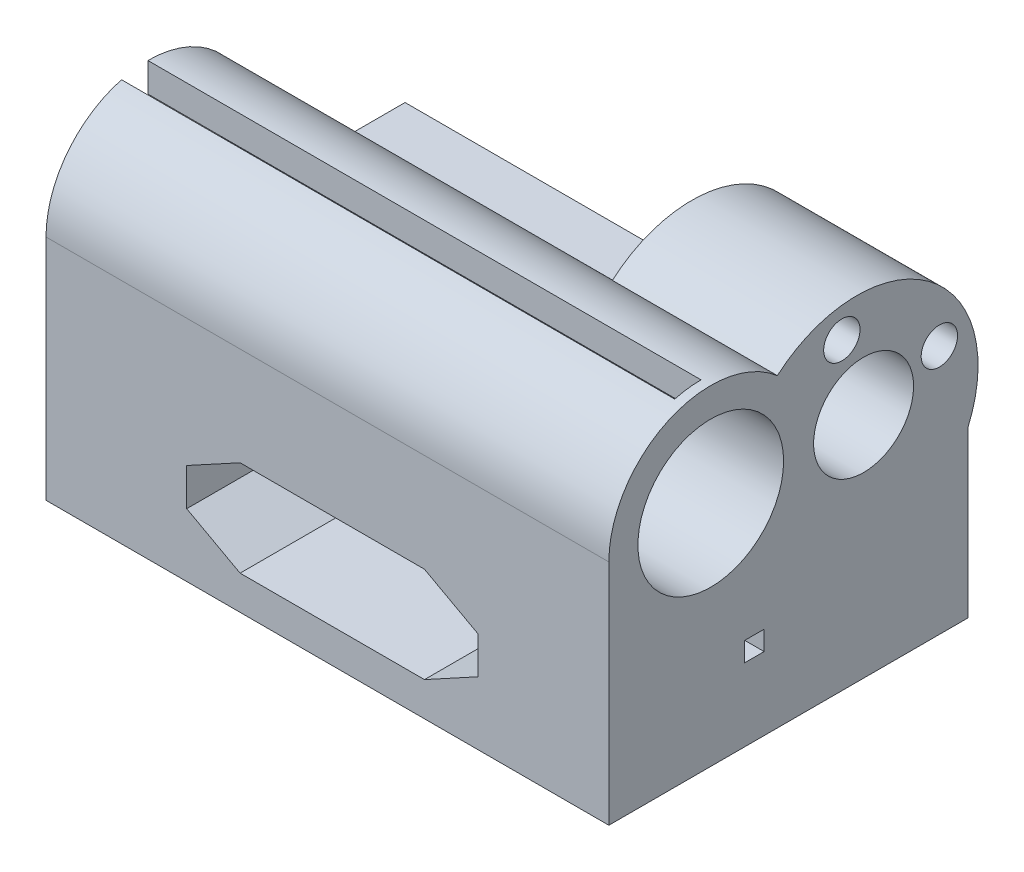
ISO-10303-21;
HEADER;
FILE_DESCRIPTION(('STEP AP214'),'2;1');
FILE_NAME('part.step','',(''),(''),'','','');
FILE_SCHEMA(('AUTOMOTIVE_DESIGN { 1 0 10303 214 1 1 1 1 }'));
ENDSEC;
DATA;
#1=APPLICATION_CONTEXT('core data for automotive mechanical design processes');
#2=APPLICATION_PROTOCOL_DEFINITION('international standard','automotive_design',2000,#1);
#3=PRODUCT_CONTEXT('',#1,'mechanical');
#4=PRODUCT('Part','Part','',(#3));
#5=PRODUCT_RELATED_PRODUCT_CATEGORY('part','',(#4));
#6=PRODUCT_DEFINITION_FORMATION('','',#4);
#7=PRODUCT_DEFINITION_CONTEXT('part definition',#1,'design');
#8=PRODUCT_DEFINITION('design','',#6,#7);
#9=PRODUCT_DEFINITION_SHAPE('','',#8);
#10=(LENGTH_UNIT() NAMED_UNIT(*) SI_UNIT(.MILLI.,.METRE.));
#11=(NAMED_UNIT(*) PLANE_ANGLE_UNIT() SI_UNIT($,.RADIAN.));
#12=(NAMED_UNIT(*) SI_UNIT($,.STERADIAN.) SOLID_ANGLE_UNIT());
#13=UNCERTAINTY_MEASURE_WITH_UNIT(LENGTH_MEASURE(1.E-05),#10,'distance_accuracy_value','');
#14=(GEOMETRIC_REPRESENTATION_CONTEXT(3) GLOBAL_UNCERTAINTY_ASSIGNED_CONTEXT((#13)) GLOBAL_UNIT_ASSIGNED_CONTEXT((#10,
#11,#12)) REPRESENTATION_CONTEXT('',''));
#15=CARTESIAN_POINT('',(0.,0.,0.));
#16=DIRECTION('',(0.,0.,1.));
#17=DIRECTION('',(1.,0.,0.));
#18=AXIS2_PLACEMENT_3D('',#15,#16,#17);
#19=CARTESIAN_POINT('',(29.,17.,18.5));
#20=DIRECTION('',(-1.,0.,0.));
#21=DIRECTION('',(0.,0.,1.));
#22=AXIS2_PLACEMENT_3D('',#19,#20,#21);
#23=PLANE('',#22);
#24=DIRECTION('',(0.,-1.,0.));
#25=VECTOR('',#24,1.);
#26=CARTESIAN_POINT('',(29.,17.,-18.5));
#27=LINE('',#26,#25);
#28=CARTESIAN_POINT('',(29.,17.,-18.5));
#29=VERTEX_POINT('',#28);
#30=CARTESIAN_POINT('',(29.,0.,-18.5));
#31=VERTEX_POINT('',#30);
#32=EDGE_CURVE('E439',#29,#31,#27,.T.);
#33=ORIENTED_EDGE('',*,*,#32,.F.);
#34=CARTESIAN_POINT('',(29.,22.,-7.04356076261039));
#35=DIRECTION('',(1.,0.,0.));
#36=DIRECTION('',(0.,0.,-1.));
#37=AXIS2_PLACEMENT_3D('',#34,#35,#36);
#38=CIRCLE('',#37,12.5);
#39=CARTESIAN_POINT('',(29.,31.4490069740523,1.1397311913841));
#40=VERTEX_POINT('',#39);
#41=EDGE_CURVE('E374',#29,#40,#38,.T.);
#42=ORIENTED_EDGE('',*,*,#41,.T.);
#43=CARTESIAN_POINT('',(29.,23.5,8.));
#44=DIRECTION('',(1.,0.,0.));
#45=DIRECTION('',(0.,0.,-1.));
#46=AXIS2_PLACEMENT_3D('',#43,#44,#45);
#47=CIRCLE('',#46,10.5);
#48=CARTESIAN_POINT('',(29.,23.5,18.5));
#49=VERTEX_POINT('',#48);
#50=EDGE_CURVE('E399',#40,#49,#47,.T.);
#51=ORIENTED_EDGE('',*,*,#50,.T.);
#52=DIRECTION('',(0.,-1.,0.));
#53=VECTOR('',#52,1.);
#54=CARTESIAN_POINT('',(29.,17.,18.5));
#55=LINE('',#54,#53);
#56=CARTESIAN_POINT('',(29.,0.,18.5));
#57=VERTEX_POINT('',#56);
#58=EDGE_CURVE('E422',#49,#57,#55,.T.);
#59=ORIENTED_EDGE('',*,*,#58,.T.);
#60=DIRECTION('',(0.,0.,-1.));
#61=VECTOR('',#60,1.);
#62=CARTESIAN_POINT('',(29.,0.,18.5));
#63=LINE('',#62,#61);
#64=EDGE_CURVE('E406',#57,#31,#63,.T.);
#65=ORIENTED_EDGE('',*,*,#64,.T.);
#66=EDGE_LOOP('',(#33,#42,#51,#59,#65));
#67=FACE_BOUND('',#66,.T.);
#68=CARTESIAN_POINT('',(29.,23.5,-7.7501439));
#69=DIRECTION('',(1.,0.,0.));
#70=DIRECTION('',(0.,0.,-1.));
#71=AXIS2_PLACEMENT_3D('',#68,#69,#70);
#72=CIRCLE('',#71,5.15);
#73=CARTESIAN_POINT('',(29.,23.5,-12.9001439));
#74=VERTEX_POINT('',#73);
#75=EDGE_CURVE('E308',#74,#74,#72,.T.);
#76=ORIENTED_EDGE('',*,*,#75,.F.);
#77=EDGE_LOOP('',(#76));
#78=FACE_BOUND('',#77,.T.);
#79=CARTESIAN_POINT('',(29.,23.5,8.));
#80=DIRECTION('',(1.,0.,0.));
#81=DIRECTION('',(0.,0.,-1.));
#82=AXIS2_PLACEMENT_3D('',#79,#80,#81);
#83=CIRCLE('',#82,7.5075);
#84=CARTESIAN_POINT('',(29.,23.5,0.492500000000002));
#85=VERTEX_POINT('',#84);
#86=EDGE_CURVE('E305',#85,#85,#83,.T.);
#87=ORIENTED_EDGE('',*,*,#86,.F.);
#88=EDGE_LOOP('',(#87));
#89=FACE_BOUND('',#88,.T.);
#90=CARTESIAN_POINT('',(29.,25.7404904729143,-15.5601264506066));
#91=DIRECTION('',(1.,0.,0.));
#92=DIRECTION('',(0.,0.,-1.));
#93=AXIS2_PLACEMENT_3D('',#90,#91,#92);
#94=CIRCLE('',#93,1.87500000000001);
#95=CARTESIAN_POINT('',(29.,25.7404904729143,-17.4351264506067));
#96=VERTEX_POINT('',#95);
#97=EDGE_CURVE('E294',#96,#96,#94,.T.);
#98=ORIENTED_EDGE('',*,*,#97,.F.);
#99=EDGE_LOOP('',(#98));
#100=FACE_BOUND('',#99,.T.);
#101=CARTESIAN_POINT('',(29.,31.3099825506067,-5.50965342708572));
#102=DIRECTION('',(1.,0.,0.));
#103=DIRECTION('',(0.,0.,-1.));
#104=AXIS2_PLACEMENT_3D('',#101,#102,#103);
#105=CIRCLE('',#104,1.875);
#106=CARTESIAN_POINT('',(29.,31.3099825506067,-7.38465342708572));
#107=VERTEX_POINT('',#106);
#108=EDGE_CURVE('E295',#107,#107,#105,.T.);
#109=ORIENTED_EDGE('',*,*,#108,.F.);
#110=EDGE_LOOP('',(#109));
#111=FACE_BOUND('',#110,.T.);
#112=DIRECTION('',(0.,1.,0.));
#113=VECTOR('',#112,1.);
#114=CARTESIAN_POINT('',(29.,7.5,4.5));
#115=LINE('',#114,#113);
#116=CARTESIAN_POINT('',(29.,7.5,4.5));
#117=VERTEX_POINT('',#116);
#118=CARTESIAN_POINT('',(29.,9.5,4.5));
#119=VERTEX_POINT('',#118);
#120=EDGE_CURVE('E58',#117,#119,#115,.T.);
#121=ORIENTED_EDGE('',*,*,#120,.T.);
#122=DIRECTION('',(0.,0.,-1.));
#123=VECTOR('',#122,1.);
#124=CARTESIAN_POINT('',(29.,9.5,4.5));
#125=LINE('',#124,#123);
#126=CARTESIAN_POINT('',(29.,9.5,2.5));
#127=VERTEX_POINT('',#126);
#128=EDGE_CURVE('E253',#119,#127,#125,.T.);
#129=ORIENTED_EDGE('',*,*,#128,.T.);
#130=DIRECTION('',(0.,-1.,0.));
#131=VECTOR('',#130,1.);
#132=CARTESIAN_POINT('',(29.,7.5,2.5));
#133=LINE('',#132,#131);
#134=CARTESIAN_POINT('',(29.,7.5,2.5));
#135=VERTEX_POINT('',#134);
#136=EDGE_CURVE('E250',#127,#135,#133,.T.);
#137=ORIENTED_EDGE('',*,*,#136,.T.);
#138=DIRECTION('',(0.,0.,1.));
#139=VECTOR('',#138,1.);
#140=CARTESIAN_POINT('',(29.,7.5,4.5));
#141=LINE('',#140,#139);
#142=EDGE_CURVE('E246',#135,#117,#141,.T.);
#143=ORIENTED_EDGE('',*,*,#142,.T.);
#144=EDGE_LOOP('',(#121,#129,#137,#143));
#145=FACE_BOUND('',#144,.T.);
#146=ADVANCED_FACE('F35',(#67,#78,#89,#100,#111,#145),#23,.F.);
#147=CARTESIAN_POINT('',(23.,8.5,4.5));
#148=DIRECTION('',(0.,0.,-1.));
#149=DIRECTION('',(-1.,0.,0.));
#150=AXIS2_PLACEMENT_3D('',#147,#148,#149);
#151=CYLINDRICAL_SURFACE('',#150,4.076);
#152=CARTESIAN_POINT('',(23.,8.5,-18.5));
#153=DIRECTION('',(0.,0.,-1.));
#154=DIRECTION('',(-1.,0.,0.));
#155=AXIS2_PLACEMENT_3D('',#152,#153,#154);
#156=CIRCLE('',#155,4.076);
#157=CARTESIAN_POINT('',(18.924,8.5,-18.5));
#158=VERTEX_POINT('',#157);
#159=EDGE_CURVE('E316',#158,#158,#156,.T.);
#160=ORIENTED_EDGE('',*,*,#159,.T.);
#161=EDGE_LOOP('',(#160));
#162=FACE_BOUND('',#161,.T.);
#163=DIRECTION('',(0.,0.,-1.));
#164=VECTOR('',#163,1.);
#165=CARTESIAN_POINT('',(26.9514270839787,9.5,4.5));
#166=LINE('',#165,#164);
#167=CARTESIAN_POINT('',(26.9514270839787,9.5,4.5));
#168=VERTEX_POINT('',#167);
#169=CARTESIAN_POINT('',(26.9514270839787,9.5,2.5));
#170=VERTEX_POINT('',#169);
#171=EDGE_CURVE('E266',#168,#170,#166,.T.);
#172=ORIENTED_EDGE('',*,*,#171,.F.);
#173=CARTESIAN_POINT('',(23.,8.5,4.5));
#174=DIRECTION('',(0.,0.,-1.));
#175=DIRECTION('',(-1.,0.,0.));
#176=AXIS2_PLACEMENT_3D('',#173,#174,#175);
#177=CIRCLE('',#176,4.076);
#178=CARTESIAN_POINT('',(26.9514270839787,7.5,4.5));
#179=VERTEX_POINT('',#178);
#180=EDGE_CURVE('E312',#179,#168,#177,.T.);
#181=ORIENTED_EDGE('',*,*,#180,.F.);
#182=DIRECTION('',(0.,0.,-1.));
#183=VECTOR('',#182,1.);
#184=CARTESIAN_POINT('',(26.9514270839787,7.5,4.5));
#185=LINE('',#184,#183);
#186=CARTESIAN_POINT('',(26.9514270839787,7.5,2.5));
#187=VERTEX_POINT('',#186);
#188=EDGE_CURVE('E259',#187,#179,#185,.F.);
#189=ORIENTED_EDGE('',*,*,#188,.F.);
#190=CARTESIAN_POINT('',(23.,8.5,2.5));
#191=DIRECTION('',(0.,0.,1.));
#192=DIRECTION('',(1.,0.,0.));
#193=AXIS2_PLACEMENT_3D('',#190,#191,#192);
#194=CIRCLE('',#193,4.076);
#195=EDGE_CURVE('E12',#170,#187,#194,.F.);
#196=ORIENTED_EDGE('',*,*,#195,.F.);
#197=EDGE_LOOP('',(#172,#181,#189,#196));
#198=FACE_BOUND('',#197,.T.);
#199=ADVANCED_FACE('F520',(#162,#198),#151,.F.);
#200=CARTESIAN_POINT('',(0.,17.,0.));
#201=DIRECTION('',(0.,-1.,0.));
#202=DIRECTION('',(0.,0.,-1.));
#203=AXIS2_PLACEMENT_3D('',#200,#201,#202);
#204=PLANE('',#203);
#205=CARTESIAN_POINT('',(0.500000000000004,17.,-11.5));
#206=DIRECTION('',(0.,-1.,0.));
#207=DIRECTION('',(0.,0.,-1.));
#208=AXIS2_PLACEMENT_3D('',#205,#206,#207);
#209=CIRCLE('',#208,1.5);
#210=CARTESIAN_POINT('',(0.500000000000004,17.,-13.));
#211=VERTEX_POINT('',#210);
#212=EDGE_CURVE('E914',#211,#211,#209,.T.);
#213=ORIENTED_EDGE('',*,*,#212,.T.);
#214=EDGE_LOOP('',(#213));
#215=FACE_BOUND('',#214,.T.);
#216=DIRECTION('',(0.,0.,1.));
#217=VECTOR('',#216,1.);
#218=CARTESIAN_POINT('',(12.,17.,0.));
#219=LINE('',#218,#217);
#220=CARTESIAN_POINT('',(12.,17.,-18.5));
#221=VERTEX_POINT('',#220);
#222=CARTESIAN_POINT('',(12.,17.,-2.5));
#223=VERTEX_POINT('',#222);
#224=EDGE_CURVE('E397',#221,#223,#219,.T.);
#225=ORIENTED_EDGE('',*,*,#224,.F.);
#226=DIRECTION('',(-1.,0.,0.));
#227=VECTOR('',#226,1.);
#228=CARTESIAN_POINT('',(-29.,17.,-18.5));
#229=LINE('',#228,#227);
#230=CARTESIAN_POINT('',(-29.,17.,-18.5));
#231=VERTEX_POINT('',#230);
#232=EDGE_CURVE('E419',#221,#231,#229,.T.);
#233=ORIENTED_EDGE('',*,*,#232,.T.);
#234=DIRECTION('',(0.,0.,1.));
#235=VECTOR('',#234,1.);
#236=CARTESIAN_POINT('',(-29.,17.,18.5));
#237=LINE('',#236,#235);
#238=CARTESIAN_POINT('',(-29.,17.,-2.5));
#239=VERTEX_POINT('',#238);
#240=EDGE_CURVE('E418',#231,#239,#237,.T.);
#241=ORIENTED_EDGE('',*,*,#240,.T.);
#242=DIRECTION('',(1.,0.,0.));
#243=VECTOR('',#242,1.);
#244=CARTESIAN_POINT('',(-56.0185121722126,17.,-2.5));
#245=LINE('',#244,#243);
#246=EDGE_CURVE('E411',#239,#223,#245,.T.);
#247=ORIENTED_EDGE('',*,*,#246,.T.);
#248=EDGE_LOOP('',(#225,#233,#241,#247));
#249=FACE_BOUND('',#248,.T.);
#250=ADVANCED_FACE('F507',(#215,#249),#204,.F.);
#251=CARTESIAN_POINT('',(-56.0185121722126,23.5,-2.5));
#252=DIRECTION('',(0.,0.,-1.));
#253=DIRECTION('',(-1.,0.,0.));
#254=AXIS2_PLACEMENT_3D('',#251,#252,#253);
#255=PLANE('',#254);
#256=DIRECTION('',(1.,0.,0.));
#257=VECTOR('',#256,1.);
#258=CARTESIAN_POINT('',(-56.0185121722126,23.5,-2.5));
#259=LINE('',#258,#257);
#260=CARTESIAN_POINT('',(-29.,23.5,-2.5));
#261=VERTEX_POINT('',#260);
#262=CARTESIAN_POINT('',(12.,23.5,-2.5));
#263=VERTEX_POINT('',#262);
#264=EDGE_CURVE('E402',#261,#263,#259,.T.);
#265=ORIENTED_EDGE('',*,*,#264,.T.);
#266=DIRECTION('',(0.,-1.,0.));
#267=VECTOR('',#266,1.);
#268=CARTESIAN_POINT('',(12.,23.5,-2.5));
#269=LINE('',#268,#267);
#270=EDGE_CURVE('E442',#263,#223,#269,.T.);
#271=ORIENTED_EDGE('',*,*,#270,.T.);
#272=ORIENTED_EDGE('',*,*,#246,.F.);
#273=DIRECTION('',(0.,-1.,0.));
#274=VECTOR('',#273,1.);
#275=CARTESIAN_POINT('',(-29.,23.5,-2.5));
#276=LINE('',#275,#274);
#277=EDGE_CURVE('E400',#261,#239,#276,.T.);
#278=ORIENTED_EDGE('',*,*,#277,.F.);
#279=EDGE_LOOP('',(#265,#271,#272,#278));
#280=FACE_BOUND('',#279,.T.);
#281=ADVANCED_FACE('F512',(#280),#255,.T.);
#282=CARTESIAN_POINT('',(-29.,17.,-18.5));
#283=DIRECTION('',(0.,0.,1.));
#284=DIRECTION('',(1.,0.,0.));
#285=AXIS2_PLACEMENT_3D('',#282,#283,#284);
#286=PLANE('',#285);
#287=ORIENTED_EDGE('',*,*,#159,.F.);
#288=EDGE_LOOP('',(#287));
#289=FACE_BOUND('',#288,.T.);
#290=CARTESIAN_POINT('',(-22.,8.5,-18.5));
#291=DIRECTION('',(0.,0.,-1.));
#292=DIRECTION('',(-1.,0.,0.));
#293=AXIS2_PLACEMENT_3D('',#290,#291,#292);
#294=CIRCLE('',#293,4.076);
#295=CARTESIAN_POINT('',(-26.076,8.5,-18.5));
#296=VERTEX_POINT('',#295);
#297=EDGE_CURVE('E322',#296,#296,#294,.T.);
#298=ORIENTED_EDGE('',*,*,#297,.F.);
#299=EDGE_LOOP('',(#298));
#300=FACE_BOUND('',#299,.T.);
#301=DIRECTION('',(-1.,0.,0.));
#302=VECTOR('',#301,1.);
#303=CARTESIAN_POINT('',(-8.99999999999999,3.5,-18.5));
#304=LINE('',#303,#302);
#305=CARTESIAN_POINT('',(10.,3.5,-18.5));
#306=VERTEX_POINT('',#305);
#307=CARTESIAN_POINT('',(-8.99999999999999,3.5,-18.5));
#308=VERTEX_POINT('',#307);
#309=EDGE_CURVE('E352',#306,#308,#304,.T.);
#310=ORIENTED_EDGE('',*,*,#309,.F.);
#311=DIRECTION('',(-0.877895572914384,-0.478852130680573,0.));
#312=VECTOR('',#311,1.);
#313=CARTESIAN_POINT('',(10.,3.5,-18.5));
#314=LINE('',#313,#312);
#315=CARTESIAN_POINT('',(15.5,6.5,-18.5));
#316=VERTEX_POINT('',#315);
#317=EDGE_CURVE('E315',#316,#306,#314,.T.);
#318=ORIENTED_EDGE('',*,*,#317,.F.);
#319=DIRECTION('',(0.,-1.,0.));
#320=VECTOR('',#319,1.);
#321=CARTESIAN_POINT('',(15.5,6.5,-18.5));
#322=LINE('',#321,#320);
#323=CARTESIAN_POINT('',(15.5,10.35,-18.5));
#324=VERTEX_POINT('',#323);
#325=EDGE_CURVE('E329',#324,#316,#322,.T.);
#326=ORIENTED_EDGE('',*,*,#325,.F.);
#327=DIRECTION('',(0.877895572914384,-0.478852130680573,0.));
#328=VECTOR('',#327,1.);
#329=CARTESIAN_POINT('',(15.5,10.35,-18.5));
#330=LINE('',#329,#328);
#331=CARTESIAN_POINT('',(10.,13.35,-18.5));
#332=VERTEX_POINT('',#331);
#333=EDGE_CURVE('E367',#332,#324,#330,.T.);
#334=ORIENTED_EDGE('',*,*,#333,.F.);
#335=DIRECTION('',(1.,0.,0.));
#336=VECTOR('',#335,1.);
#337=CARTESIAN_POINT('',(10.,13.35,-18.5));
#338=LINE('',#337,#336);
#339=CARTESIAN_POINT('',(-9.00000000000001,13.35,-18.5));
#340=VERTEX_POINT('',#339);
#341=EDGE_CURVE('E364',#340,#332,#338,.T.);
#342=ORIENTED_EDGE('',*,*,#341,.F.);
#343=DIRECTION('',(0.878365103433168,0.477990319013723,0.));
#344=VECTOR('',#343,1.);
#345=CARTESIAN_POINT('',(-9.00000000000001,13.35,-18.5));
#346=LINE('',#345,#344);
#347=CARTESIAN_POINT('',(-14.5,10.357,-18.5));
#348=VERTEX_POINT('',#347);
#349=EDGE_CURVE('E361',#348,#340,#346,.T.);
#350=ORIENTED_EDGE('',*,*,#349,.F.);
#351=DIRECTION('',(0.,1.,0.));
#352=VECTOR('',#351,1.);
#353=CARTESIAN_POINT('',(-14.5,10.357,-18.5));
#354=LINE('',#353,#352);
#355=CARTESIAN_POINT('',(-14.5,6.5,-18.5));
#356=VERTEX_POINT('',#355);
#357=EDGE_CURVE('E358',#356,#348,#354,.T.);
#358=ORIENTED_EDGE('',*,*,#357,.F.);
#359=DIRECTION('',(-0.877895572914384,0.478852130680573,0.));
#360=VECTOR('',#359,1.);
#361=CARTESIAN_POINT('',(-14.5,6.5,-18.5));
#362=LINE('',#361,#360);
#363=EDGE_CURVE('E355',#308,#356,#362,.T.);
#364=ORIENTED_EDGE('',*,*,#363,.F.);
#365=EDGE_LOOP('',(#310,#318,#326,#334,#342,#350,#358,#364));
#366=FACE_BOUND('',#365,.T.);
#367=DIRECTION('',(-1.,0.,0.));
#368=VECTOR('',#367,1.);
#369=CARTESIAN_POINT('',(-29.,0.,-18.5));
#370=LINE('',#369,#368);
#371=CARTESIAN_POINT('',(-29.,0.,-18.5));
#372=VERTEX_POINT('',#371);
#373=EDGE_CURVE('E425',#31,#372,#370,.T.);
#374=ORIENTED_EDGE('',*,*,#373,.T.);
#375=DIRECTION('',(0.,-1.,0.));
#376=VECTOR('',#375,1.);
#377=CARTESIAN_POINT('',(-29.,17.,-18.5));
#378=LINE('',#377,#376);
#379=EDGE_CURVE('E436',#231,#372,#378,.T.);
#380=ORIENTED_EDGE('',*,*,#379,.F.);
#381=ORIENTED_EDGE('',*,*,#232,.F.);
#382=EDGE_CURVE('E416',#29,#221,#229,.T.);
#383=ORIENTED_EDGE('',*,*,#382,.F.);
#384=ORIENTED_EDGE('',*,*,#32,.T.);
#385=EDGE_LOOP('',(#374,#380,#381,#383,#384));
#386=FACE_BOUND('',#385,.T.);
#387=ADVANCED_FACE('F478',(#289,#300,#366,#386),#286,.F.);
#388=CARTESIAN_POINT('',(-29.,17.,18.5));
#389=DIRECTION('',(1.,0.,0.));
#390=DIRECTION('',(0.,0.,-1.));
#391=AXIS2_PLACEMENT_3D('',#388,#389,#390);
#392=PLANE('',#391);
#393=DIRECTION('',(0.,0.,-1.));
#394=VECTOR('',#393,1.);
#395=CARTESIAN_POINT('',(-29.,9.5,4.5));
#396=LINE('',#395,#394);
#397=CARTESIAN_POINT('',(-29.,9.5,4.5));
#398=VERTEX_POINT('',#397);
#399=CARTESIAN_POINT('',(-29.,9.5,2.5));
#400=VERTEX_POINT('',#399);
#401=EDGE_CURVE('E270',#398,#400,#396,.T.);
#402=ORIENTED_EDGE('',*,*,#401,.F.);
#403=DIRECTION('',(0.,1.,0.));
#404=VECTOR('',#403,1.);
#405=CARTESIAN_POINT('',(-29.,7.5,4.5));
#406=LINE('',#405,#404);
#407=CARTESIAN_POINT('',(-29.,7.5,4.5));
#408=VERTEX_POINT('',#407);
#409=EDGE_CURVE('E268',#408,#398,#406,.T.);
#410=ORIENTED_EDGE('',*,*,#409,.F.);
#411=DIRECTION('',(0.,0.,1.));
#412=VECTOR('',#411,1.);
#413=CARTESIAN_POINT('',(-29.,7.5,4.5));
#414=LINE('',#413,#412);
#415=CARTESIAN_POINT('',(-29.,7.5,2.5));
#416=VERTEX_POINT('',#415);
#417=EDGE_CURVE('E276',#416,#408,#414,.T.);
#418=ORIENTED_EDGE('',*,*,#417,.F.);
#419=DIRECTION('',(0.,-1.,0.));
#420=VECTOR('',#419,1.);
#421=CARTESIAN_POINT('',(-29.,7.5,2.5));
#422=LINE('',#421,#420);
#423=EDGE_CURVE('E273',#400,#416,#422,.T.);
#424=ORIENTED_EDGE('',*,*,#423,.F.);
#425=EDGE_LOOP('',(#402,#410,#418,#424));
#426=FACE_BOUND('',#425,.T.);
#427=CARTESIAN_POINT('',(-29.,23.5,8.));
#428=DIRECTION('',(1.,0.,0.));
#429=DIRECTION('',(0.,0.,-1.));
#430=AXIS2_PLACEMENT_3D('',#427,#428,#429);
#431=CIRCLE('',#430,10.5);
#432=CARTESIAN_POINT('',(-29.,23.5,18.5));
#433=VERTEX_POINT('',#432);
#434=CARTESIAN_POINT('',(-29.,33.6422211760352,10.7175999735764));
#435=VERTEX_POINT('',#434);
#436=EDGE_CURVE('E403',#433,#435,#431,.F.);
#437=ORIENTED_EDGE('',*,*,#436,.T.);
#438=DIRECTION('',(0.,0.965925826289069,0.258819045102517));
#439=VECTOR('',#438,1.);
#440=CARTESIAN_POINT('',(-29.,-0.425798494467172,1.58910161513784));
#441=LINE('',#440,#439);
#442=CARTESIAN_POINT('',(-29.,30.7516881408652,9.94308398110716));
#443=VERTEX_POINT('',#442);
#444=EDGE_CURVE('E233',#443,#435,#441,.T.);
#445=ORIENTED_EDGE('',*,*,#444,.F.);
#446=CARTESIAN_POINT('',(-29.,23.5,8.));
#447=DIRECTION('',(1.,0.,0.));
#448=DIRECTION('',(0.,0.,-1.));
#449=AXIS2_PLACEMENT_3D('',#446,#447,#448);
#450=CIRCLE('',#449,7.5075);
#451=CARTESIAN_POINT('',(-29.,31.0075,8.00000000000003));
#452=VERTEX_POINT('',#451);
#453=EDGE_CURVE('E301',#443,#452,#450,.T.);
#454=ORIENTED_EDGE('',*,*,#453,.T.);
#455=DIRECTION('',(0.,-1.,0.));
#456=VECTOR('',#455,1.);
#457=CARTESIAN_POINT('',(-29.,0.,7.99999999999992));
#458=LINE('',#457,#456);
#459=CARTESIAN_POINT('',(-29.,34.,8.00000000000004));
#460=VERTEX_POINT('',#459);
#461=EDGE_CURVE('E913',#460,#452,#458,.T.);
#462=ORIENTED_EDGE('',*,*,#461,.F.);
#463=EDGE_CURVE('E238',#460,#261,#431,.F.);
#464=ORIENTED_EDGE('',*,*,#463,.T.);
#465=ORIENTED_EDGE('',*,*,#277,.T.);
#466=ORIENTED_EDGE('',*,*,#240,.F.);
#467=ORIENTED_EDGE('',*,*,#379,.T.);
#468=DIRECTION('',(0.,0.,1.));
#469=VECTOR('',#468,1.);
#470=CARTESIAN_POINT('',(-29.,0.,18.5));
#471=LINE('',#470,#469);
#472=CARTESIAN_POINT('',(-29.,0.,18.5));
#473=VERTEX_POINT('',#472);
#474=EDGE_CURVE('E427',#372,#473,#471,.T.);
#475=ORIENTED_EDGE('',*,*,#474,.T.);
#476=DIRECTION('',(0.,-1.,0.));
#477=VECTOR('',#476,1.);
#478=CARTESIAN_POINT('',(-29.,17.,18.5));
#479=LINE('',#478,#477);
#480=EDGE_CURVE('E433',#433,#473,#479,.T.);
#481=ORIENTED_EDGE('',*,*,#480,.F.);
#482=EDGE_LOOP('',(#437,#445,#454,#462,#464,#465,#466,#467,#475,#481));
#483=FACE_BOUND('',#482,.T.);
#484=ADVANCED_FACE('F474',(#426,#483),#392,.F.);
#485=CARTESIAN_POINT('',(-29.,17.,18.5));
#486=DIRECTION('',(0.,0.,-1.));
#487=DIRECTION('',(-1.,0.,0.));
#488=AXIS2_PLACEMENT_3D('',#485,#486,#487);
#489=PLANE('',#488);
#490=DIRECTION('',(0.,-1.,0.));
#491=VECTOR('',#490,1.);
#492=CARTESIAN_POINT('',(15.5,6.5,18.5));
#493=LINE('',#492,#491);
#494=CARTESIAN_POINT('',(15.5,10.35,18.5));
#495=VERTEX_POINT('',#494);
#496=CARTESIAN_POINT('',(15.5,6.5,18.5));
#497=VERTEX_POINT('',#496);
#498=EDGE_CURVE('E347',#495,#497,#493,.T.);
#499=ORIENTED_EDGE('',*,*,#498,.T.);
#500=DIRECTION('',(-0.877895572914384,-0.478852130680573,0.));
#501=VECTOR('',#500,1.);
#502=CARTESIAN_POINT('',(10.,3.5,18.5));
#503=LINE('',#502,#501);
#504=CARTESIAN_POINT('',(10.,3.5,18.5));
#505=VERTEX_POINT('',#504);
#506=EDGE_CURVE('E325',#497,#505,#503,.T.);
#507=ORIENTED_EDGE('',*,*,#506,.T.);
#508=DIRECTION('',(-1.,0.,0.));
#509=VECTOR('',#508,1.);
#510=CARTESIAN_POINT('',(-8.99999999999999,3.5,18.5));
#511=LINE('',#510,#509);
#512=CARTESIAN_POINT('',(-8.99999999999999,3.5,18.5));
#513=VERTEX_POINT('',#512);
#514=EDGE_CURVE('E328',#505,#513,#511,.T.);
#515=ORIENTED_EDGE('',*,*,#514,.T.);
#516=DIRECTION('',(-0.877895572914384,0.478852130680573,0.));
#517=VECTOR('',#516,1.);
#518=CARTESIAN_POINT('',(-14.5,6.5,18.5));
#519=LINE('',#518,#517);
#520=CARTESIAN_POINT('',(-14.5,6.5,18.5));
#521=VERTEX_POINT('',#520);
#522=EDGE_CURVE('E332',#513,#521,#519,.T.);
#523=ORIENTED_EDGE('',*,*,#522,.T.);
#524=DIRECTION('',(0.,1.,0.));
#525=VECTOR('',#524,1.);
#526=CARTESIAN_POINT('',(-14.5,10.357,18.5));
#527=LINE('',#526,#525);
#528=CARTESIAN_POINT('',(-14.5,10.357,18.5));
#529=VERTEX_POINT('',#528);
#530=EDGE_CURVE('E335',#521,#529,#527,.T.);
#531=ORIENTED_EDGE('',*,*,#530,.T.);
#532=DIRECTION('',(0.878365103433168,0.477990319013723,0.));
#533=VECTOR('',#532,1.);
#534=CARTESIAN_POINT('',(-9.00000000000001,13.35,18.5));
#535=LINE('',#534,#533);
#536=CARTESIAN_POINT('',(-9.00000000000001,13.35,18.5));
#537=VERTEX_POINT('',#536);
#538=EDGE_CURVE('E338',#529,#537,#535,.T.);
#539=ORIENTED_EDGE('',*,*,#538,.T.);
#540=DIRECTION('',(1.,0.,0.));
#541=VECTOR('',#540,1.);
#542=CARTESIAN_POINT('',(10.,13.35,18.5));
#543=LINE('',#542,#541);
#544=CARTESIAN_POINT('',(10.,13.35,18.5));
#545=VERTEX_POINT('',#544);
#546=EDGE_CURVE('E341',#537,#545,#543,.T.);
#547=ORIENTED_EDGE('',*,*,#546,.T.);
#548=DIRECTION('',(0.877895572914384,-0.478852130680573,0.));
#549=VECTOR('',#548,1.);
#550=CARTESIAN_POINT('',(15.5,10.35,18.5));
#551=LINE('',#550,#549);
#552=EDGE_CURVE('E344',#545,#495,#551,.T.);
#553=ORIENTED_EDGE('',*,*,#552,.T.);
#554=EDGE_LOOP('',(#499,#507,#515,#523,#531,#539,#547,#553));
#555=FACE_BOUND('',#554,.T.);
#556=DIRECTION('',(1.,0.,0.));
#557=VECTOR('',#556,1.);
#558=CARTESIAN_POINT('',(-29.,0.,18.5));
#559=LINE('',#558,#557);
#560=EDGE_CURVE('E429',#473,#57,#559,.T.);
#561=ORIENTED_EDGE('',*,*,#560,.T.);
#562=ORIENTED_EDGE('',*,*,#58,.F.);
#563=DIRECTION('',(1.,0.,0.));
#564=VECTOR('',#563,1.);
#565=CARTESIAN_POINT('',(-56.0185121722126,23.5,18.5));
#566=LINE('',#565,#564);
#567=EDGE_CURVE('E408',#433,#49,#566,.T.);
#568=ORIENTED_EDGE('',*,*,#567,.F.);
#569=ORIENTED_EDGE('',*,*,#480,.T.);
#570=EDGE_LOOP('',(#561,#562,#568,#569));
#571=FACE_BOUND('',#570,.T.);
#572=ADVANCED_FACE('F477',(#555,#571),#489,.F.);
#573=CARTESIAN_POINT('',(0.,0.,0.));
#574=DIRECTION('',(0.,-1.,0.));
#575=DIRECTION('',(0.,0.,-1.));
#576=AXIS2_PLACEMENT_3D('',#573,#574,#575);
#577=PLANE('',#576);
#578=CARTESIAN_POINT('',(0.500000000000004,0.,-11.5));
#579=DIRECTION('',(0.,-1.,0.));
#580=DIRECTION('',(0.,0.,-1.));
#581=AXIS2_PLACEMENT_3D('',#578,#579,#580);
#582=CIRCLE('',#581,1.5);
#583=CARTESIAN_POINT('',(0.500000000000004,0.,-13.));
#584=VERTEX_POINT('',#583);
#585=EDGE_CURVE('E925',#584,#584,#582,.T.);
#586=ORIENTED_EDGE('',*,*,#585,.F.);
#587=EDGE_LOOP('',(#586));
#588=FACE_BOUND('',#587,.T.);
#589=ORIENTED_EDGE('',*,*,#64,.F.);
#590=ORIENTED_EDGE('',*,*,#560,.F.);
#591=ORIENTED_EDGE('',*,*,#474,.F.);
#592=ORIENTED_EDGE('',*,*,#373,.F.);
#593=EDGE_LOOP('',(#589,#590,#591,#592));
#594=FACE_BOUND('',#593,.T.);
#595=ADVANCED_FACE('F493',(#588,#594),#577,.T.);
#596=CARTESIAN_POINT('',(-56.0185121722126,23.5,8.));
#597=DIRECTION('',(1.,0.,0.));
#598=DIRECTION('',(0.,0.,-1.));
#599=AXIS2_PLACEMENT_3D('',#596,#597,#598);
#600=CYLINDRICAL_SURFACE('',#599,10.5);
#601=DIRECTION('',(-1.,0.,0.));
#602=VECTOR('',#601,1.);
#603=CARTESIAN_POINT('',(28.,33.6422211760352,10.7175999735764));
#604=LINE('',#603,#602);
#605=CARTESIAN_POINT('',(28.,33.6422211760352,10.7175999735764));
#606=VERTEX_POINT('',#605);
#607=EDGE_CURVE('E247',#606,#435,#604,.T.);
#608=ORIENTED_EDGE('',*,*,#607,.T.);
#609=ORIENTED_EDGE('',*,*,#436,.F.);
#610=ORIENTED_EDGE('',*,*,#567,.T.);
#611=ORIENTED_EDGE('',*,*,#50,.F.);
#612=DIRECTION('',(1.,0.,0.));
#613=VECTOR('',#612,1.);
#614=CARTESIAN_POINT('',(20.5,31.4490069740523,1.13973119138409));
#615=LINE('',#614,#613);
#616=CARTESIAN_POINT('',(12.,31.4490069740523,1.1397311913841));
#617=VERTEX_POINT('',#616);
#618=EDGE_CURVE('E445',#617,#40,#615,.T.);
#619=ORIENTED_EDGE('',*,*,#618,.F.);
#620=CARTESIAN_POINT('',(12.,23.5,8.));
#621=DIRECTION('',(1.,0.,0.));
#622=DIRECTION('',(0.,0.,-1.));
#623=AXIS2_PLACEMENT_3D('',#620,#621,#622);
#624=CIRCLE('',#623,10.5);
#625=EDGE_CURVE('E392',#617,#263,#624,.F.);
#626=ORIENTED_EDGE('',*,*,#625,.T.);
#627=ORIENTED_EDGE('',*,*,#264,.F.);
#628=ORIENTED_EDGE('',*,*,#463,.F.);
#629=DIRECTION('',(-1.,0.,0.));
#630=VECTOR('',#629,1.);
#631=CARTESIAN_POINT('',(28.,34.,8.00000000000004));
#632=LINE('',#631,#630);
#633=CARTESIAN_POINT('',(28.,34.,8.00000000000004));
#634=VERTEX_POINT('',#633);
#635=EDGE_CURVE('E218',#634,#460,#632,.T.);
#636=ORIENTED_EDGE('',*,*,#635,.F.);
#637=CARTESIAN_POINT('',(28.,23.5,8.));
#638=DIRECTION('',(-1.,0.,0.));
#639=DIRECTION('',(0.,0.,1.));
#640=AXIS2_PLACEMENT_3D('',#637,#638,#639);
#641=CIRCLE('',#640,10.5);
#642=EDGE_CURVE('E224',#606,#634,#641,.T.);
#643=ORIENTED_EDGE('',*,*,#642,.F.);
#644=EDGE_LOOP('',(#608,#609,#610,#611,#619,#626,#627,#628,#636,#643));
#645=FACE_BOUND('',#644,.T.);
#646=ADVANCED_FACE('F236',(#645),#600,.T.);
#647=CARTESIAN_POINT('',(12.,22.,-7.04356076261039));
#648=DIRECTION('',(1.,0.,0.));
#649=DIRECTION('',(0.,0.,-1.));
#650=AXIS2_PLACEMENT_3D('',#647,#648,#649);
#651=CYLINDRICAL_SURFACE('',#650,12.5);
#652=ORIENTED_EDGE('',*,*,#382,.T.);
#653=CARTESIAN_POINT('',(12.,22.,-7.04356076261039));
#654=DIRECTION('',(1.,0.,0.));
#655=DIRECTION('',(0.,0.,-1.));
#656=AXIS2_PLACEMENT_3D('',#653,#654,#655);
#657=CIRCLE('',#656,12.5);
#658=EDGE_CURVE('E389',#221,#617,#657,.T.);
#659=ORIENTED_EDGE('',*,*,#658,.T.);
#660=ORIENTED_EDGE('',*,*,#618,.T.);
#661=ORIENTED_EDGE('',*,*,#41,.F.);
#662=EDGE_LOOP('',(#652,#659,#660,#661));
#663=FACE_BOUND('',#662,.T.);
#664=ADVANCED_FACE('F501',(#663),#651,.T.);
#665=CARTESIAN_POINT('',(12.,22.,-7.04356076261039));
#666=DIRECTION('',(1.,0.,0.));
#667=DIRECTION('',(0.,0.,-1.));
#668=AXIS2_PLACEMENT_3D('',#665,#666,#667);
#669=PLANE('',#668);
#670=CARTESIAN_POINT('',(12.,31.3099825506067,-5.50965342708572));
#671=DIRECTION('',(1.,0.,0.));
#672=DIRECTION('',(0.,0.,-1.));
#673=AXIS2_PLACEMENT_3D('',#670,#671,#672);
#674=CIRCLE('',#673,1.875);
#675=CARTESIAN_POINT('',(12.,31.3099825506067,-7.38465342708572));
#676=VERTEX_POINT('',#675);
#677=EDGE_CURVE('E311',#676,#676,#674,.T.);
#678=ORIENTED_EDGE('',*,*,#677,.T.);
#679=EDGE_LOOP('',(#678));
#680=FACE_BOUND('',#679,.T.);
#681=CARTESIAN_POINT('',(12.,25.7404904729143,-15.5601264506066));
#682=DIRECTION('',(1.,0.,0.));
#683=DIRECTION('',(0.,0.,-1.));
#684=AXIS2_PLACEMENT_3D('',#681,#682,#683);
#685=CIRCLE('',#684,1.87500000000001);
#686=CARTESIAN_POINT('',(12.,25.7404904729143,-17.4351264506067));
#687=VERTEX_POINT('',#686);
#688=EDGE_CURVE('E298',#687,#687,#685,.T.);
#689=ORIENTED_EDGE('',*,*,#688,.T.);
#690=EDGE_LOOP('',(#689));
#691=FACE_BOUND('',#690,.T.);
#692=CARTESIAN_POINT('',(12.,23.5,-7.7501439));
#693=DIRECTION('',(1.,0.,0.));
#694=DIRECTION('',(0.,0.,-1.));
#695=AXIS2_PLACEMENT_3D('',#692,#693,#694);
#696=CIRCLE('',#695,5.15);
#697=CARTESIAN_POINT('',(12.,23.5,-12.9001439));
#698=VERTEX_POINT('',#697);
#699=EDGE_CURVE('E304',#698,#698,#696,.T.);
#700=ORIENTED_EDGE('',*,*,#699,.T.);
#701=EDGE_LOOP('',(#700));
#702=FACE_BOUND('',#701,.T.);
#703=ORIENTED_EDGE('',*,*,#658,.F.);
#704=ORIENTED_EDGE('',*,*,#224,.T.);
#705=ORIENTED_EDGE('',*,*,#270,.F.);
#706=ORIENTED_EDGE('',*,*,#625,.F.);
#707=EDGE_LOOP('',(#703,#704,#705,#706));
#708=FACE_BOUND('',#707,.T.);
#709=ADVANCED_FACE('F505',(#680,#691,#702,#708),#669,.F.);
#710=CARTESIAN_POINT('',(10.,3.5,18.5));
#711=DIRECTION('',(0.478852130680573,-0.877895572914384,0.));
#712=DIRECTION('',(0.877895572914384,0.478852130680573,0.));
#713=AXIS2_PLACEMENT_3D('',#710,#711,#712);
#714=PLANE('',#713);
#715=ORIENTED_EDGE('',*,*,#317,.T.);
#716=DIRECTION('',(0.,0.,-1.));
#717=VECTOR('',#716,1.);
#718=CARTESIAN_POINT('',(10.,3.5,18.5));
#719=LINE('',#718,#717);
#720=EDGE_CURVE('E350',#505,#306,#719,.T.);
#721=ORIENTED_EDGE('',*,*,#720,.F.);
#722=ORIENTED_EDGE('',*,*,#506,.F.);
#723=DIRECTION('',(0.,0.,-1.));
#724=VECTOR('',#723,1.);
#725=CARTESIAN_POINT('',(15.5,6.5,18.5));
#726=LINE('',#725,#724);
#727=EDGE_CURVE('E372',#497,#316,#726,.T.);
#728=ORIENTED_EDGE('',*,*,#727,.T.);
#729=EDGE_LOOP('',(#715,#721,#722,#728));
#730=FACE_BOUND('',#729,.T.);
#731=ADVANCED_FACE('F547',(#730),#714,.F.);
#732=CARTESIAN_POINT('',(15.5,6.5,18.5));
#733=DIRECTION('',(1.,0.,0.));
#734=DIRECTION('',(0.,0.,-1.));
#735=AXIS2_PLACEMENT_3D('',#732,#733,#734);
#736=PLANE('',#735);
#737=ORIENTED_EDGE('',*,*,#325,.T.);
#738=ORIENTED_EDGE('',*,*,#727,.F.);
#739=ORIENTED_EDGE('',*,*,#498,.F.);
#740=DIRECTION('',(0.,0.,-1.));
#741=VECTOR('',#740,1.);
#742=CARTESIAN_POINT('',(15.5,10.35,18.5));
#743=LINE('',#742,#741);
#744=EDGE_CURVE('E375',#495,#324,#743,.T.);
#745=ORIENTED_EDGE('',*,*,#744,.T.);
#746=EDGE_LOOP('',(#737,#738,#739,#745));
#747=FACE_BOUND('',#746,.T.);
#748=ADVANCED_FACE('F543',(#747),#736,.F.);
#749=CARTESIAN_POINT('',(15.5,10.35,18.5));
#750=DIRECTION('',(0.478852130680573,0.877895572914384,0.));
#751=DIRECTION('',(-0.877895572914384,0.478852130680573,0.));
#752=AXIS2_PLACEMENT_3D('',#749,#750,#751);
#753=PLANE('',#752);
#754=ORIENTED_EDGE('',*,*,#333,.T.);
#755=ORIENTED_EDGE('',*,*,#744,.F.);
#756=ORIENTED_EDGE('',*,*,#552,.F.);
#757=DIRECTION('',(0.,0.,-1.));
#758=VECTOR('',#757,1.);
#759=CARTESIAN_POINT('',(10.,13.35,18.5));
#760=LINE('',#759,#758);
#761=EDGE_CURVE('E377',#545,#332,#760,.T.);
#762=ORIENTED_EDGE('',*,*,#761,.T.);
#763=EDGE_LOOP('',(#754,#755,#756,#762));
#764=FACE_BOUND('',#763,.T.);
#765=ADVANCED_FACE('F546',(#764),#753,.F.);
#766=CARTESIAN_POINT('',(10.,13.35,18.5));
#767=DIRECTION('',(0.,1.,0.));
#768=DIRECTION('',(0.,0.,1.));
#769=AXIS2_PLACEMENT_3D('',#766,#767,#768);
#770=PLANE('',#769);
#771=CARTESIAN_POINT('',(0.500000000000004,13.35,-11.5));
#772=DIRECTION('',(0.,1.,0.));
#773=DIRECTION('',(0.,0.,1.));
#774=AXIS2_PLACEMENT_3D('',#771,#772,#773);
#775=CIRCLE('',#774,1.5);
#776=CARTESIAN_POINT('',(0.500000000000004,13.35,-9.99999999999999));
#777=VERTEX_POINT('',#776);
#778=EDGE_CURVE('E918',#777,#777,#775,.T.);
#779=ORIENTED_EDGE('',*,*,#778,.T.);
#780=EDGE_LOOP('',(#779));
#781=FACE_BOUND('',#780,.T.);
#782=ORIENTED_EDGE('',*,*,#341,.T.);
#783=ORIENTED_EDGE('',*,*,#761,.F.);
#784=ORIENTED_EDGE('',*,*,#546,.F.);
#785=DIRECTION('',(0.,0.,-1.));
#786=VECTOR('',#785,1.);
#787=CARTESIAN_POINT('',(-9.00000000000001,13.35,18.5));
#788=LINE('',#787,#786);
#789=EDGE_CURVE('E379',#537,#340,#788,.T.);
#790=ORIENTED_EDGE('',*,*,#789,.T.);
#791=EDGE_LOOP('',(#782,#783,#784,#790));
#792=FACE_BOUND('',#791,.T.);
#793=ADVANCED_FACE('F551',(#781,#792),#770,.F.);
#794=CARTESIAN_POINT('',(-9.00000000000001,13.35,18.5));
#795=DIRECTION('',(-0.477990319013722,0.878365103433168,0.));
#796=DIRECTION('',(-0.878365103433168,-0.477990319013722,0.));
#797=AXIS2_PLACEMENT_3D('',#794,#795,#796);
#798=PLANE('',#797);
#799=ORIENTED_EDGE('',*,*,#349,.T.);
#800=ORIENTED_EDGE('',*,*,#789,.F.);
#801=ORIENTED_EDGE('',*,*,#538,.F.);
#802=DIRECTION('',(0.,0.,-1.));
#803=VECTOR('',#802,1.);
#804=CARTESIAN_POINT('',(-14.5,10.357,18.5));
#805=LINE('',#804,#803);
#806=EDGE_CURVE('E381',#529,#348,#805,.T.);
#807=ORIENTED_EDGE('',*,*,#806,.T.);
#808=EDGE_LOOP('',(#799,#800,#801,#807));
#809=FACE_BOUND('',#808,.T.);
#810=ADVANCED_FACE('F555',(#809),#798,.F.);
#811=CARTESIAN_POINT('',(-14.5,10.357,18.5));
#812=DIRECTION('',(-1.,0.,0.));
#813=DIRECTION('',(0.,-1.,0.));
#814=AXIS2_PLACEMENT_3D('',#811,#812,#813);
#815=PLANE('',#814);
#816=ORIENTED_EDGE('',*,*,#357,.T.);
#817=ORIENTED_EDGE('',*,*,#806,.F.);
#818=ORIENTED_EDGE('',*,*,#530,.F.);
#819=DIRECTION('',(0.,0.,-1.));
#820=VECTOR('',#819,1.);
#821=CARTESIAN_POINT('',(-14.5,6.5,18.5));
#822=LINE('',#821,#820);
#823=EDGE_CURVE('E383',#521,#356,#822,.T.);
#824=ORIENTED_EDGE('',*,*,#823,.T.);
#825=EDGE_LOOP('',(#816,#817,#818,#824));
#826=FACE_BOUND('',#825,.T.);
#827=ADVANCED_FACE('F559',(#826),#815,.F.);
#828=CARTESIAN_POINT('',(-14.5,6.5,18.5));
#829=DIRECTION('',(-0.478852130680573,-0.877895572914384,0.));
#830=DIRECTION('',(0.877895572914384,-0.478852130680573,0.));
#831=AXIS2_PLACEMENT_3D('',#828,#829,#830);
#832=PLANE('',#831);
#833=ORIENTED_EDGE('',*,*,#363,.T.);
#834=ORIENTED_EDGE('',*,*,#823,.F.);
#835=ORIENTED_EDGE('',*,*,#522,.F.);
#836=DIRECTION('',(0.,0.,-1.));
#837=VECTOR('',#836,1.);
#838=CARTESIAN_POINT('',(-8.99999999999999,3.5,18.5));
#839=LINE('',#838,#837);
#840=EDGE_CURVE('E385',#513,#308,#839,.T.);
#841=ORIENTED_EDGE('',*,*,#840,.T.);
#842=EDGE_LOOP('',(#833,#834,#835,#841));
#843=FACE_BOUND('',#842,.T.);
#844=ADVANCED_FACE('F563',(#843),#832,.F.);
#845=CARTESIAN_POINT('',(-8.99999999999999,3.5,18.5));
#846=DIRECTION('',(0.,-1.,0.));
#847=DIRECTION('',(1.,0.,0.));
#848=AXIS2_PLACEMENT_3D('',#845,#846,#847);
#849=PLANE('',#848);
#850=CARTESIAN_POINT('',(0.500000000000004,3.5,-11.5));
#851=DIRECTION('',(0.,-1.,0.));
#852=DIRECTION('',(1.,0.,0.));
#853=AXIS2_PLACEMENT_3D('',#850,#851,#852);
#854=CIRCLE('',#853,1.5);
#855=CARTESIAN_POINT('',(2.,3.5,-11.5));
#856=VERTEX_POINT('',#855);
#857=EDGE_CURVE('E38',#856,#856,#854,.T.);
#858=ORIENTED_EDGE('',*,*,#857,.T.);
#859=EDGE_LOOP('',(#858));
#860=FACE_BOUND('',#859,.T.);
#861=ORIENTED_EDGE('',*,*,#309,.T.);
#862=ORIENTED_EDGE('',*,*,#840,.F.);
#863=ORIENTED_EDGE('',*,*,#514,.F.);
#864=ORIENTED_EDGE('',*,*,#720,.T.);
#865=EDGE_LOOP('',(#861,#862,#863,#864));
#866=FACE_BOUND('',#865,.T.);
#867=ADVANCED_FACE('F542',(#860,#866),#849,.F.);
#868=CARTESIAN_POINT('',(-22.,8.5,4.5));
#869=DIRECTION('',(0.,0.,-1.));
#870=DIRECTION('',(-1.,0.,0.));
#871=AXIS2_PLACEMENT_3D('',#868,#869,#870);
#872=CYLINDRICAL_SURFACE('',#871,4.076);
#873=CARTESIAN_POINT('',(-22.,8.5,2.5));
#874=DIRECTION('',(0.,0.,-1.));
#875=DIRECTION('',(-1.,0.,0.));
#876=AXIS2_PLACEMENT_3D('',#873,#874,#875);
#877=CIRCLE('',#876,4.076);
#878=CARTESIAN_POINT('',(-25.9514270839786,9.5,2.5));
#879=VERTEX_POINT('',#878);
#880=CARTESIAN_POINT('',(-25.9514270839786,7.5,2.5));
#881=VERTEX_POINT('',#880);
#882=EDGE_CURVE('E43',#879,#881,#877,.F.);
#883=ORIENTED_EDGE('',*,*,#882,.T.);
#884=DIRECTION('',(0.,0.,-1.));
#885=VECTOR('',#884,1.);
#886=CARTESIAN_POINT('',(-25.9514270839786,7.5,4.5));
#887=LINE('',#886,#885);
#888=CARTESIAN_POINT('',(-25.9514270839786,7.5,4.5));
#889=VERTEX_POINT('',#888);
#890=EDGE_CURVE('E291',#881,#889,#887,.F.);
#891=ORIENTED_EDGE('',*,*,#890,.T.);
#892=CARTESIAN_POINT('',(-22.,8.5,4.5));
#893=DIRECTION('',(0.,0.,-1.));
#894=DIRECTION('',(-1.,0.,0.));
#895=AXIS2_PLACEMENT_3D('',#892,#893,#894);
#896=CIRCLE('',#895,4.076);
#897=CARTESIAN_POINT('',(-25.9514270839786,9.5,4.5));
#898=VERTEX_POINT('',#897);
#899=EDGE_CURVE('E319',#898,#889,#896,.T.);
#900=ORIENTED_EDGE('',*,*,#899,.F.);
#901=DIRECTION('',(0.,0.,-1.));
#902=VECTOR('',#901,1.);
#903=CARTESIAN_POINT('',(-25.9514270839786,9.5,4.5));
#904=LINE('',#903,#902);
#905=EDGE_CURVE('E282',#898,#879,#904,.T.);
#906=ORIENTED_EDGE('',*,*,#905,.T.);
#907=EDGE_LOOP('',(#883,#891,#900,#906));
#908=FACE_BOUND('',#907,.T.);
#909=ORIENTED_EDGE('',*,*,#297,.T.);
#910=EDGE_LOOP('',(#909));
#911=FACE_BOUND('',#910,.T.);
#912=ADVANCED_FACE('F456',(#908,#911),#872,.F.);
#913=CARTESIAN_POINT('',(-22.,8.5,4.5));
#914=DIRECTION('',(0.,0.,-1.));
#915=DIRECTION('',(-1.,0.,0.));
#916=AXIS2_PLACEMENT_3D('',#913,#914,#915);
#917=PLANE('',#916);
#918=ORIENTED_EDGE('',*,*,#899,.T.);
#919=DIRECTION('',(-1.,0.,0.));
#920=VECTOR('',#919,1.);
#921=CARTESIAN_POINT('',(-21.,7.5,4.5));
#922=LINE('',#921,#920);
#923=EDGE_CURVE('E280',#889,#408,#922,.T.);
#924=ORIENTED_EDGE('',*,*,#923,.T.);
#925=ORIENTED_EDGE('',*,*,#409,.T.);
#926=DIRECTION('',(-1.,0.,0.));
#927=VECTOR('',#926,1.);
#928=CARTESIAN_POINT('',(-21.,9.5,4.5));
#929=LINE('',#928,#927);
#930=EDGE_CURVE('E279',#898,#398,#929,.T.);
#931=ORIENTED_EDGE('',*,*,#930,.F.);
#932=EDGE_LOOP('',(#918,#924,#925,#931));
#933=FACE_BOUND('',#932,.T.);
#934=ADVANCED_FACE('F468',(#933),#917,.T.);
#935=CARTESIAN_POINT('',(23.,8.5,4.5));
#936=DIRECTION('',(0.,0.,-1.));
#937=DIRECTION('',(-1.,0.,0.));
#938=AXIS2_PLACEMENT_3D('',#935,#936,#937);
#939=PLANE('',#938);
#940=ORIENTED_EDGE('',*,*,#180,.T.);
#941=DIRECTION('',(1.,0.,0.));
#942=VECTOR('',#941,1.);
#943=CARTESIAN_POINT('',(21.,9.5,4.5));
#944=LINE('',#943,#942);
#945=EDGE_CURVE('E257',#168,#119,#944,.T.);
#946=ORIENTED_EDGE('',*,*,#945,.T.);
#947=ORIENTED_EDGE('',*,*,#120,.F.);
#948=DIRECTION('',(1.,0.,0.));
#949=VECTOR('',#948,1.);
#950=CARTESIAN_POINT('',(21.,7.5,4.5));
#951=LINE('',#950,#949);
#952=EDGE_CURVE('E256',#179,#117,#951,.T.);
#953=ORIENTED_EDGE('',*,*,#952,.F.);
#954=EDGE_LOOP('',(#940,#946,#947,#953));
#955=FACE_BOUND('',#954,.T.);
#956=ADVANCED_FACE('F536',(#955),#939,.T.);
#957=CARTESIAN_POINT('',(-29.,23.5,-7.7501439));
#958=DIRECTION('',(1.,0.,0.));
#959=DIRECTION('',(0.,0.,-1.));
#960=AXIS2_PLACEMENT_3D('',#957,#958,#959);
#961=CYLINDRICAL_SURFACE('',#960,5.15);
#962=ORIENTED_EDGE('',*,*,#75,.T.);
#963=EDGE_LOOP('',(#962));
#964=FACE_BOUND('',#963,.T.);
#965=ORIENTED_EDGE('',*,*,#699,.F.);
#966=EDGE_LOOP('',(#965));
#967=FACE_BOUND('',#966,.T.);
#968=ADVANCED_FACE('F701',(#964,#967),#961,.F.);
#969=CARTESIAN_POINT('',(-29.,23.5,8.));
#970=DIRECTION('',(1.,0.,0.));
#971=DIRECTION('',(0.,0.,-1.));
#972=AXIS2_PLACEMENT_3D('',#969,#970,#971);
#973=CYLINDRICAL_SURFACE('',#972,7.5075);
#974=ORIENTED_EDGE('',*,*,#453,.F.);
#975=DIRECTION('',(-1.,0.,0.));
#976=VECTOR('',#975,1.);
#977=CARTESIAN_POINT('',(28.,30.7516881408652,9.94308398110716));
#978=LINE('',#977,#976);
#979=CARTESIAN_POINT('',(28.,30.7516881408652,9.94308398110716));
#980=VERTEX_POINT('',#979);
#981=EDGE_CURVE('E240',#980,#443,#978,.T.);
#982=ORIENTED_EDGE('',*,*,#981,.F.);
#983=CARTESIAN_POINT('',(28.,23.5,8.));
#984=DIRECTION('',(-1.,0.,0.));
#985=DIRECTION('',(0.,0.,1.));
#986=AXIS2_PLACEMENT_3D('',#983,#984,#985);
#987=CIRCLE('',#986,7.5075);
#988=CARTESIAN_POINT('',(28.,31.0075,8.00000000000003));
#989=VERTEX_POINT('',#988);
#990=EDGE_CURVE('E223',#989,#980,#987,.F.);
#991=ORIENTED_EDGE('',*,*,#990,.F.);
#992=DIRECTION('',(-1.,0.,0.));
#993=VECTOR('',#992,1.);
#994=CARTESIAN_POINT('',(28.,31.0075,8.00000000000003));
#995=LINE('',#994,#993);
#996=EDGE_CURVE('E221',#989,#452,#995,.T.);
#997=ORIENTED_EDGE('',*,*,#996,.T.);
#998=EDGE_LOOP('',(#974,#982,#991,#997));
#999=FACE_BOUND('',#998,.T.);
#1000=ORIENTED_EDGE('',*,*,#86,.T.);
#1001=EDGE_LOOP('',(#1000));
#1002=FACE_BOUND('',#1001,.T.);
#1003=ADVANCED_FACE('F698',(#999,#1002),#973,.F.);
#1004=CARTESIAN_POINT('',(-29.,25.7404904729143,-15.5601264506066));
#1005=DIRECTION('',(1.,0.,0.));
#1006=DIRECTION('',(0.,0.,-1.));
#1007=AXIS2_PLACEMENT_3D('',#1004,#1005,#1006);
#1008=CYLINDRICAL_SURFACE('',#1007,1.87500000000001);
#1009=ORIENTED_EDGE('',*,*,#97,.T.);
#1010=EDGE_LOOP('',(#1009));
#1011=FACE_BOUND('',#1010,.T.);
#1012=ORIENTED_EDGE('',*,*,#688,.F.);
#1013=EDGE_LOOP('',(#1012));
#1014=FACE_BOUND('',#1013,.T.);
#1015=ADVANCED_FACE('F694',(#1011,#1014),#1008,.F.);
#1016=CARTESIAN_POINT('',(-29.,31.3099825506067,-5.50965342708572));
#1017=DIRECTION('',(1.,0.,0.));
#1018=DIRECTION('',(0.,0.,-1.));
#1019=AXIS2_PLACEMENT_3D('',#1016,#1017,#1018);
#1020=CYLINDRICAL_SURFACE('',#1019,1.875);
#1021=ORIENTED_EDGE('',*,*,#108,.T.);
#1022=EDGE_LOOP('',(#1021));
#1023=FACE_BOUND('',#1022,.T.);
#1024=ORIENTED_EDGE('',*,*,#677,.F.);
#1025=EDGE_LOOP('',(#1024));
#1026=FACE_BOUND('',#1025,.T.);
#1027=ADVANCED_FACE('F689',(#1023,#1026),#1020,.F.);
#1028=CARTESIAN_POINT('',(-21.,7.5,2.5));
#1029=DIRECTION('',(0.,0.,-1.));
#1030=DIRECTION('',(-1.,0.,0.));
#1031=AXIS2_PLACEMENT_3D('',#1028,#1029,#1030);
#1032=PLANE('',#1031);
#1033=DIRECTION('',(-1.,0.,0.));
#1034=VECTOR('',#1033,1.);
#1035=CARTESIAN_POINT('',(-21.,9.5,2.5));
#1036=LINE('',#1035,#1034);
#1037=EDGE_CURVE('E285',#879,#400,#1036,.T.);
#1038=ORIENTED_EDGE('',*,*,#1037,.T.);
#1039=ORIENTED_EDGE('',*,*,#423,.T.);
#1040=DIRECTION('',(-1.,0.,0.));
#1041=VECTOR('',#1040,1.);
#1042=CARTESIAN_POINT('',(-21.,7.5,2.5));
#1043=LINE('',#1042,#1041);
#1044=EDGE_CURVE('E283',#881,#416,#1043,.T.);
#1045=ORIENTED_EDGE('',*,*,#1044,.F.);
#1046=ORIENTED_EDGE('',*,*,#882,.F.);
#1047=EDGE_LOOP('',(#1038,#1039,#1045,#1046));
#1048=FACE_BOUND('',#1047,.T.);
#1049=ADVANCED_FACE('F461',(#1048),#1032,.F.);
#1050=CARTESIAN_POINT('',(-21.,7.5,4.5));
#1051=DIRECTION('',(0.,-1.,0.));
#1052=DIRECTION('',(0.,0.,-1.));
#1053=AXIS2_PLACEMENT_3D('',#1050,#1051,#1052);
#1054=PLANE('',#1053);
#1055=ORIENTED_EDGE('',*,*,#1044,.T.);
#1056=ORIENTED_EDGE('',*,*,#417,.T.);
#1057=ORIENTED_EDGE('',*,*,#923,.F.);
#1058=ORIENTED_EDGE('',*,*,#890,.F.);
#1059=EDGE_LOOP('',(#1055,#1056,#1057,#1058));
#1060=FACE_BOUND('',#1059,.T.);
#1061=ADVANCED_FACE('F465',(#1060),#1054,.F.);
#1062=CARTESIAN_POINT('',(-21.,9.5,4.5));
#1063=DIRECTION('',(0.,1.,0.));
#1064=DIRECTION('',(0.,0.,1.));
#1065=AXIS2_PLACEMENT_3D('',#1062,#1063,#1064);
#1066=PLANE('',#1065);
#1067=ORIENTED_EDGE('',*,*,#930,.T.);
#1068=ORIENTED_EDGE('',*,*,#401,.T.);
#1069=ORIENTED_EDGE('',*,*,#1037,.F.);
#1070=ORIENTED_EDGE('',*,*,#905,.F.);
#1071=EDGE_LOOP('',(#1067,#1068,#1069,#1070));
#1072=FACE_BOUND('',#1071,.T.);
#1073=ADVANCED_FACE('F472',(#1072),#1066,.F.);
#1074=CARTESIAN_POINT('',(21.,7.5,2.5));
#1075=DIRECTION('',(0.,0.,1.));
#1076=DIRECTION('',(1.,0.,0.));
#1077=AXIS2_PLACEMENT_3D('',#1074,#1075,#1076);
#1078=PLANE('',#1077);
#1079=ORIENTED_EDGE('',*,*,#195,.T.);
#1080=DIRECTION('',(1.,0.,0.));
#1081=VECTOR('',#1080,1.);
#1082=CARTESIAN_POINT('',(21.,7.5,2.5));
#1083=LINE('',#1082,#1081);
#1084=EDGE_CURVE('E262',#187,#135,#1083,.T.);
#1085=ORIENTED_EDGE('',*,*,#1084,.T.);
#1086=ORIENTED_EDGE('',*,*,#136,.F.);
#1087=DIRECTION('',(1.,0.,0.));
#1088=VECTOR('',#1087,1.);
#1089=CARTESIAN_POINT('',(21.,9.5,2.5));
#1090=LINE('',#1089,#1088);
#1091=EDGE_CURVE('E260',#170,#127,#1090,.T.);
#1092=ORIENTED_EDGE('',*,*,#1091,.F.);
#1093=EDGE_LOOP('',(#1079,#1085,#1086,#1092));
#1094=FACE_BOUND('',#1093,.T.);
#1095=ADVANCED_FACE('F677',(#1094),#1078,.T.);
#1096=CARTESIAN_POINT('',(21.,9.5,4.5));
#1097=DIRECTION('',(0.,-1.,0.));
#1098=DIRECTION('',(0.,0.,-1.));
#1099=AXIS2_PLACEMENT_3D('',#1096,#1097,#1098);
#1100=PLANE('',#1099);
#1101=ORIENTED_EDGE('',*,*,#171,.T.);
#1102=ORIENTED_EDGE('',*,*,#1091,.T.);
#1103=ORIENTED_EDGE('',*,*,#128,.F.);
#1104=ORIENTED_EDGE('',*,*,#945,.F.);
#1105=EDGE_LOOP('',(#1101,#1102,#1103,#1104));
#1106=FACE_BOUND('',#1105,.T.);
#1107=ADVANCED_FACE('F674',(#1106),#1100,.T.);
#1108=CARTESIAN_POINT('',(21.,7.5,4.5));
#1109=DIRECTION('',(0.,1.,0.));
#1110=DIRECTION('',(0.,0.,1.));
#1111=AXIS2_PLACEMENT_3D('',#1108,#1109,#1110);
#1112=PLANE('',#1111);
#1113=ORIENTED_EDGE('',*,*,#188,.T.);
#1114=ORIENTED_EDGE('',*,*,#952,.T.);
#1115=ORIENTED_EDGE('',*,*,#142,.F.);
#1116=ORIENTED_EDGE('',*,*,#1084,.F.);
#1117=EDGE_LOOP('',(#1113,#1114,#1115,#1116));
#1118=FACE_BOUND('',#1117,.T.);
#1119=ADVANCED_FACE('F670',(#1118),#1112,.T.);
#1120=CARTESIAN_POINT('',(28.,-0.425798494467172,1.58910161513784));
#1121=DIRECTION('',(0.,-0.258819045102517,0.965925826289069));
#1122=DIRECTION('',(0.,-0.965925826289069,-0.258819045102517));
#1123=AXIS2_PLACEMENT_3D('',#1120,#1121,#1122);
#1124=PLANE('',#1123);
#1125=ORIENTED_EDGE('',*,*,#444,.T.);
#1126=ORIENTED_EDGE('',*,*,#607,.F.);
#1127=DIRECTION('',(0.,0.965925826289069,0.258819045102517));
#1128=VECTOR('',#1127,1.);
#1129=CARTESIAN_POINT('',(28.,-0.425798494467172,1.58910161513784));
#1130=LINE('',#1129,#1128);
#1131=EDGE_CURVE('E230',#980,#606,#1130,.T.);
#1132=ORIENTED_EDGE('',*,*,#1131,.F.);
#1133=ORIENTED_EDGE('',*,*,#981,.T.);
#1134=EDGE_LOOP('',(#1125,#1126,#1132,#1133));
#1135=FACE_BOUND('',#1134,.T.);
#1136=ADVANCED_FACE('F667',(#1135),#1124,.F.);
#1137=CARTESIAN_POINT('',(28.,0.,7.99999999999992));
#1138=DIRECTION('',(0.,0.,-1.));
#1139=DIRECTION('',(0.,1.,0.));
#1140=AXIS2_PLACEMENT_3D('',#1137,#1138,#1139);
#1141=PLANE('',#1140);
#1142=ORIENTED_EDGE('',*,*,#461,.T.);
#1143=ORIENTED_EDGE('',*,*,#996,.F.);
#1144=DIRECTION('',(0.,-1.,0.));
#1145=VECTOR('',#1144,1.);
#1146=CARTESIAN_POINT('',(28.,0.,7.99999999999992));
#1147=LINE('',#1146,#1145);
#1148=EDGE_CURVE('E50',#634,#989,#1147,.T.);
#1149=ORIENTED_EDGE('',*,*,#1148,.F.);
#1150=ORIENTED_EDGE('',*,*,#635,.T.);
#1151=EDGE_LOOP('',(#1142,#1143,#1149,#1150));
#1152=FACE_BOUND('',#1151,.T.);
#1153=ADVANCED_FACE('F216',(#1152),#1141,.F.);
#1154=CARTESIAN_POINT('',(28.,0.,0.));
#1155=DIRECTION('',(-1.,0.,0.));
#1156=DIRECTION('',(0.,0.,1.));
#1157=AXIS2_PLACEMENT_3D('',#1154,#1155,#1156);
#1158=PLANE('',#1157);
#1159=ORIENTED_EDGE('',*,*,#642,.T.);
#1160=ORIENTED_EDGE('',*,*,#1148,.T.);
#1161=ORIENTED_EDGE('',*,*,#990,.T.);
#1162=ORIENTED_EDGE('',*,*,#1131,.T.);
#1163=EDGE_LOOP('',(#1159,#1160,#1161,#1162));
#1164=FACE_BOUND('',#1163,.T.);
#1165=ADVANCED_FACE('F228',(#1164),#1158,.T.);
#1166=CARTESIAN_POINT('',(0.500000000000004,34.5,-11.5));
#1167=DIRECTION('',(0.,-1.,0.));
#1168=DIRECTION('',(0.,0.,-1.));
#1169=AXIS2_PLACEMENT_3D('',#1166,#1167,#1168);
#1170=CYLINDRICAL_SURFACE('',#1169,1.5);
#1171=ORIENTED_EDGE('',*,*,#585,.T.);
#1172=EDGE_LOOP('',(#1171));
#1173=FACE_BOUND('',#1172,.T.);
#1174=ORIENTED_EDGE('',*,*,#857,.F.);
#1175=EDGE_LOOP('',(#1174));
#1176=FACE_BOUND('',#1175,.T.);
#1177=ADVANCED_FACE('F643',(#1173,#1176),#1170,.F.);
#1178=ORIENTED_EDGE('',*,*,#778,.F.);
#1179=EDGE_LOOP('',(#1178));
#1180=FACE_BOUND('',#1179,.T.);
#1181=ORIENTED_EDGE('',*,*,#212,.F.);
#1182=EDGE_LOOP('',(#1181));
#1183=FACE_BOUND('',#1182,.T.);
#1184=ADVANCED_FACE('F648',(#1180,#1183),#1170,.F.);
#1185=CLOSED_SHELL('',(#146,#199,#250,#281,#387,#484,#572,#595,#646,#664,#709,#731,#748,#765,
#793,#810,#827,#844,#867,#912,#934,#956,#968,#1003,#1015,#1027,#1049,#1061,#1073,#1095,#1107,
#1119,#1136,#1153,#1165,#1177,#1184));
#1186=MANIFOLD_SOLID_BREP('B2',#1185);
#1187=ADVANCED_BREP_SHAPE_REPRESENTATION('',(#18,#1186),#14);
#1188=SHAPE_DEFINITION_REPRESENTATION(#9,#1187);
ENDSEC;
END-ISO-10303-21;
